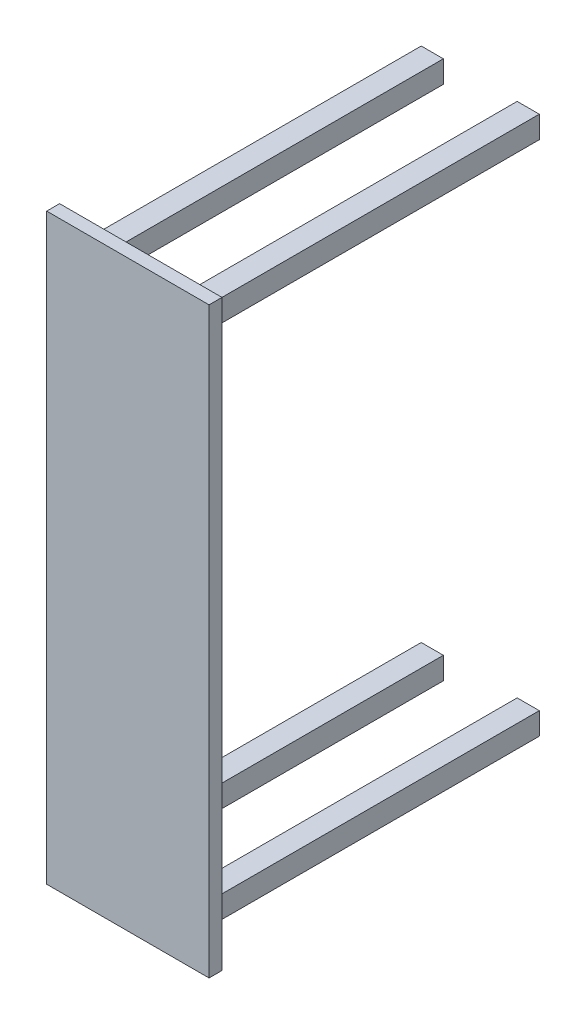
ISO-10303-21;
HEADER;
FILE_DESCRIPTION(('STEP AP214'),'2;1');
FILE_NAME('part.step','',(''),(''),'','','');
FILE_SCHEMA(('AUTOMOTIVE_DESIGN { 1 0 10303 214 1 1 1 1 }'));
ENDSEC;
DATA;
#1=APPLICATION_CONTEXT('core data for automotive mechanical design processes');
#2=APPLICATION_PROTOCOL_DEFINITION('international standard','automotive_design',2000,#1);
#3=PRODUCT_CONTEXT('',#1,'mechanical');
#4=PRODUCT('Part','Part','',(#3));
#5=PRODUCT_RELATED_PRODUCT_CATEGORY('part','',(#4));
#6=PRODUCT_DEFINITION_FORMATION('','',#4);
#7=PRODUCT_DEFINITION_CONTEXT('part definition',#1,'design');
#8=PRODUCT_DEFINITION('design','',#6,#7);
#9=PRODUCT_DEFINITION_SHAPE('','',#8);
#10=(LENGTH_UNIT() NAMED_UNIT(*) SI_UNIT(.MILLI.,.METRE.));
#11=(NAMED_UNIT(*) PLANE_ANGLE_UNIT() SI_UNIT($,.RADIAN.));
#12=(NAMED_UNIT(*) SI_UNIT($,.STERADIAN.) SOLID_ANGLE_UNIT());
#13=UNCERTAINTY_MEASURE_WITH_UNIT(LENGTH_MEASURE(1.E-05),#10,'distance_accuracy_value','');
#14=(GEOMETRIC_REPRESENTATION_CONTEXT(3) GLOBAL_UNCERTAINTY_ASSIGNED_CONTEXT((#13)) GLOBAL_UNIT_ASSIGNED_CONTEXT((#10,
#11,#12)) REPRESENTATION_CONTEXT('',''));
#15=CARTESIAN_POINT('',(0.,0.,0.));
#16=DIRECTION('',(0.,0.,1.));
#17=DIRECTION('',(1.,0.,0.));
#18=AXIS2_PLACEMENT_3D('',#15,#16,#17);
#19=CARTESIAN_POINT('',(0.,0.,0.));
#20=DIRECTION('',(0.,0.,1.));
#21=DIRECTION('',(1.,0.,0.));
#22=AXIS2_PLACEMENT_3D('',#19,#20,#21);
#23=PLANE('',#22);
#24=DIRECTION('',(0.,-1.,0.));
#25=VECTOR('',#24,1.);
#26=CARTESIAN_POINT('',(203.2,-850.9,0.));
#27=LINE('',#26,#25);
#28=CARTESIAN_POINT('',(203.2,-850.9,0.));
#29=VERTEX_POINT('',#28);
#30=CARTESIAN_POINT('',(203.2,-927.1,0.));
#31=VERTEX_POINT('',#30);
#32=EDGE_CURVE('E191',#29,#31,#27,.T.);
#33=ORIENTED_EDGE('',*,*,#32,.F.);
#34=DIRECTION('',(1.,0.,0.));
#35=VECTOR('',#34,1.);
#36=CARTESIAN_POINT('',(203.2,-850.9,0.));
#37=LINE('',#36,#35);
#38=CARTESIAN_POINT('',(127.,-850.9,0.));
#39=VERTEX_POINT('',#38);
#40=EDGE_CURVE('E204',#39,#29,#37,.T.);
#41=ORIENTED_EDGE('',*,*,#40,.F.);
#42=DIRECTION('',(0.,1.,0.));
#43=VECTOR('',#42,1.);
#44=CARTESIAN_POINT('',(127.,-850.9,0.));
#45=LINE('',#44,#43);
#46=CARTESIAN_POINT('',(127.,-927.1,0.));
#47=VERTEX_POINT('',#46);
#48=EDGE_CURVE('E213',#47,#39,#45,.T.);
#49=ORIENTED_EDGE('',*,*,#48,.F.);
#50=DIRECTION('',(-1.,0.,0.));
#51=VECTOR('',#50,1.);
#52=CARTESIAN_POINT('',(203.2,-927.1,0.));
#53=LINE('',#52,#51);
#54=EDGE_CURVE('E194',#31,#47,#53,.T.);
#55=ORIENTED_EDGE('',*,*,#54,.F.);
#56=EDGE_LOOP('',(#33,#41,#49,#55));
#57=FACE_BOUND('',#56,.T.);
#58=DIRECTION('',(0.,-1.,0.));
#59=VECTOR('',#58,1.);
#60=CARTESIAN_POINT('',(203.2,927.1,0.));
#61=LINE('',#60,#59);
#62=CARTESIAN_POINT('',(203.2,927.1,0.));
#63=VERTEX_POINT('',#62);
#64=CARTESIAN_POINT('',(203.2,850.9,0.));
#65=VERTEX_POINT('',#64);
#66=EDGE_CURVE('E262',#63,#65,#61,.T.);
#67=ORIENTED_EDGE('',*,*,#66,.F.);
#68=DIRECTION('',(1.,0.,0.));
#69=VECTOR('',#68,1.);
#70=CARTESIAN_POINT('',(203.2,927.1,0.));
#71=LINE('',#70,#69);
#72=CARTESIAN_POINT('',(127.,927.1,0.));
#73=VERTEX_POINT('',#72);
#74=EDGE_CURVE('E267',#73,#63,#71,.T.);
#75=ORIENTED_EDGE('',*,*,#74,.F.);
#76=DIRECTION('',(0.,1.,0.));
#77=VECTOR('',#76,1.);
#78=CARTESIAN_POINT('',(127.,927.1,0.));
#79=LINE('',#78,#77);
#80=CARTESIAN_POINT('',(127.,850.9,0.));
#81=VERTEX_POINT('',#80);
#82=EDGE_CURVE('E279',#81,#73,#79,.T.);
#83=ORIENTED_EDGE('',*,*,#82,.F.);
#84=DIRECTION('',(-1.,0.,0.));
#85=VECTOR('',#84,1.);
#86=CARTESIAN_POINT('',(203.2,850.9,0.));
#87=LINE('',#86,#85);
#88=EDGE_CURVE('E276',#65,#81,#87,.T.);
#89=ORIENTED_EDGE('',*,*,#88,.F.);
#90=EDGE_LOOP('',(#67,#75,#83,#89));
#91=FACE_BOUND('',#90,.T.);
#92=DIRECTION('',(0.,1.,0.));
#93=VECTOR('',#92,1.);
#94=CARTESIAN_POINT('',(279.4,1003.3,0.));
#95=LINE('',#94,#93);
#96=CARTESIAN_POINT('',(279.4,-1003.3,0.));
#97=VERTEX_POINT('',#96);
#98=CARTESIAN_POINT('',(279.4,1003.3,0.));
#99=VERTEX_POINT('',#98);
#100=EDGE_CURVE('E295',#97,#99,#95,.T.);
#101=ORIENTED_EDGE('',*,*,#100,.F.);
#102=DIRECTION('',(1.,0.,0.));
#103=VECTOR('',#102,1.);
#104=CARTESIAN_POINT('',(-279.4,-1003.3,0.));
#105=LINE('',#104,#103);
#106=CARTESIAN_POINT('',(-279.4,-1003.3,0.));
#107=VERTEX_POINT('',#106);
#108=EDGE_CURVE('E300',#107,#97,#105,.T.);
#109=ORIENTED_EDGE('',*,*,#108,.F.);
#110=DIRECTION('',(0.,-1.,0.));
#111=VECTOR('',#110,1.);
#112=CARTESIAN_POINT('',(-279.4,1003.3,0.));
#113=LINE('',#112,#111);
#114=CARTESIAN_POINT('',(-279.4,1003.3,0.));
#115=VERTEX_POINT('',#114);
#116=EDGE_CURVE('E311',#115,#107,#113,.T.);
#117=ORIENTED_EDGE('',*,*,#116,.F.);
#118=DIRECTION('',(-1.,0.,0.));
#119=VECTOR('',#118,1.);
#120=CARTESIAN_POINT('',(-279.4,1003.3,0.));
#121=LINE('',#120,#119);
#122=EDGE_CURVE('E309',#99,#115,#121,.T.);
#123=ORIENTED_EDGE('',*,*,#122,.F.);
#124=EDGE_LOOP('',(#101,#109,#117,#123));
#125=FACE_BOUND('',#124,.T.);
#126=DIRECTION('',(0.,-1.,0.));
#127=VECTOR('',#126,1.);
#128=CARTESIAN_POINT('',(-127.,927.1,0.));
#129=LINE('',#128,#127);
#130=CARTESIAN_POINT('',(-127.,927.1,0.));
#131=VERTEX_POINT('',#130);
#132=CARTESIAN_POINT('',(-127.,850.9,0.));
#133=VERTEX_POINT('',#132);
#134=EDGE_CURVE('E229',#131,#133,#129,.T.);
#135=ORIENTED_EDGE('',*,*,#134,.F.);
#136=DIRECTION('',(1.,0.,0.));
#137=VECTOR('',#136,1.);
#138=CARTESIAN_POINT('',(-127.,927.1,0.));
#139=LINE('',#138,#137);
#140=CARTESIAN_POINT('',(-203.2,927.1,0.));
#141=VERTEX_POINT('',#140);
#142=EDGE_CURVE('E234',#141,#131,#139,.T.);
#143=ORIENTED_EDGE('',*,*,#142,.F.);
#144=DIRECTION('',(0.,1.,0.));
#145=VECTOR('',#144,1.);
#146=CARTESIAN_POINT('',(-203.2,927.1,0.));
#147=LINE('',#146,#145);
#148=CARTESIAN_POINT('',(-203.2,850.9,0.));
#149=VERTEX_POINT('',#148);
#150=EDGE_CURVE('E246',#149,#141,#147,.T.);
#151=ORIENTED_EDGE('',*,*,#150,.F.);
#152=DIRECTION('',(-1.,0.,0.));
#153=VECTOR('',#152,1.);
#154=CARTESIAN_POINT('',(-127.,850.9,0.));
#155=LINE('',#154,#153);
#156=EDGE_CURVE('E243',#133,#149,#155,.T.);
#157=ORIENTED_EDGE('',*,*,#156,.F.);
#158=EDGE_LOOP('',(#135,#143,#151,#157));
#159=FACE_BOUND('',#158,.T.);
#160=DIRECTION('',(0.,-1.,0.));
#161=VECTOR('',#160,1.);
#162=CARTESIAN_POINT('',(-127.,-850.9,0.));
#163=LINE('',#162,#161);
#164=CARTESIAN_POINT('',(-127.,-850.9,0.));
#165=VERTEX_POINT('',#164);
#166=CARTESIAN_POINT('',(-127.,-927.1,0.));
#167=VERTEX_POINT('',#166);
#168=EDGE_CURVE('E190',#165,#167,#163,.T.);
#169=ORIENTED_EDGE('',*,*,#168,.F.);
#170=DIRECTION('',(1.,0.,0.));
#171=VECTOR('',#170,1.);
#172=CARTESIAN_POINT('',(-127.,-850.9,0.));
#173=LINE('',#172,#171);
#174=CARTESIAN_POINT('',(-203.2,-850.9,0.));
#175=VERTEX_POINT('',#174);
#176=EDGE_CURVE('E187',#175,#165,#173,.T.);
#177=ORIENTED_EDGE('',*,*,#176,.F.);
#178=DIRECTION('',(0.,1.,0.));
#179=VECTOR('',#178,1.);
#180=CARTESIAN_POINT('',(-203.2,-850.9,0.));
#181=LINE('',#180,#179);
#182=CARTESIAN_POINT('',(-203.2,-927.1,0.));
#183=VERTEX_POINT('',#182);
#184=EDGE_CURVE('E53',#183,#175,#181,.T.);
#185=ORIENTED_EDGE('',*,*,#184,.F.);
#186=DIRECTION('',(-1.,0.,0.));
#187=VECTOR('',#186,1.);
#188=CARTESIAN_POINT('',(-127.,-927.1,0.));
#189=LINE('',#188,#187);
#190=EDGE_CURVE('E48',#167,#183,#189,.T.);
#191=ORIENTED_EDGE('',*,*,#190,.F.);
#192=EDGE_LOOP('',(#169,#177,#185,#191));
#193=FACE_BOUND('',#192,.T.);
#194=ADVANCED_FACE('F33',(#57,#91,#125,#159,#193),#23,.F.);
#195=CARTESIAN_POINT('',(279.4,1003.3,44.45));
#196=DIRECTION('',(-1.,0.,0.));
#197=DIRECTION('',(0.,-1.,0.));
#198=AXIS2_PLACEMENT_3D('',#195,#196,#197);
#199=PLANE('',#198);
#200=ORIENTED_EDGE('',*,*,#100,.T.);
#201=DIRECTION('',(0.,0.,-1.));
#202=VECTOR('',#201,1.);
#203=CARTESIAN_POINT('',(279.4,1003.3,44.45));
#204=LINE('',#203,#202);
#205=CARTESIAN_POINT('',(279.4,1003.3,44.45));
#206=VERTEX_POINT('',#205);
#207=EDGE_CURVE('E11',#206,#99,#204,.T.);
#208=ORIENTED_EDGE('',*,*,#207,.F.);
#209=DIRECTION('',(0.,1.,0.));
#210=VECTOR('',#209,1.);
#211=CARTESIAN_POINT('',(279.4,1003.3,44.45));
#212=LINE('',#211,#210);
#213=CARTESIAN_POINT('',(279.4,-1003.3,44.45));
#214=VERTEX_POINT('',#213);
#215=EDGE_CURVE('E296',#214,#206,#212,.T.);
#216=ORIENTED_EDGE('',*,*,#215,.F.);
#217=DIRECTION('',(0.,0.,-1.));
#218=VECTOR('',#217,1.);
#219=CARTESIAN_POINT('',(279.4,-1003.3,44.45));
#220=LINE('',#219,#218);
#221=EDGE_CURVE('E306',#214,#97,#220,.T.);
#222=ORIENTED_EDGE('',*,*,#221,.T.);
#223=EDGE_LOOP('',(#200,#208,#216,#222));
#224=FACE_BOUND('',#223,.T.);
#225=ADVANCED_FACE('F35',(#224),#199,.F.);
#226=CARTESIAN_POINT('',(-279.4,1003.3,44.45));
#227=DIRECTION('',(0.,-1.,0.));
#228=DIRECTION('',(0.,0.,-1.));
#229=AXIS2_PLACEMENT_3D('',#226,#227,#228);
#230=PLANE('',#229);
#231=ORIENTED_EDGE('',*,*,#122,.T.);
#232=DIRECTION('',(0.,0.,-1.));
#233=VECTOR('',#232,1.);
#234=CARTESIAN_POINT('',(-279.4,1003.3,44.45));
#235=LINE('',#234,#233);
#236=CARTESIAN_POINT('',(-279.4,1003.3,44.45));
#237=VERTEX_POINT('',#236);
#238=EDGE_CURVE('E41',#237,#115,#235,.T.);
#239=ORIENTED_EDGE('',*,*,#238,.F.);
#240=DIRECTION('',(-1.,0.,0.));
#241=VECTOR('',#240,1.);
#242=CARTESIAN_POINT('',(-279.4,1003.3,44.45));
#243=LINE('',#242,#241);
#244=EDGE_CURVE('E299',#206,#237,#243,.T.);
#245=ORIENTED_EDGE('',*,*,#244,.F.);
#246=ORIENTED_EDGE('',*,*,#207,.T.);
#247=EDGE_LOOP('',(#231,#239,#245,#246));
#248=FACE_BOUND('',#247,.T.);
#249=ADVANCED_FACE('F339',(#248),#230,.F.);
#250=CARTESIAN_POINT('',(-279.4,1003.3,44.45));
#251=DIRECTION('',(1.,0.,0.));
#252=DIRECTION('',(0.,1.,0.));
#253=AXIS2_PLACEMENT_3D('',#250,#251,#252);
#254=PLANE('',#253);
#255=ORIENTED_EDGE('',*,*,#116,.T.);
#256=DIRECTION('',(0.,0.,-1.));
#257=VECTOR('',#256,1.);
#258=CARTESIAN_POINT('',(-279.4,-1003.3,44.45));
#259=LINE('',#258,#257);
#260=CARTESIAN_POINT('',(-279.4,-1003.3,44.45));
#261=VERTEX_POINT('',#260);
#262=EDGE_CURVE('E316',#261,#107,#259,.T.);
#263=ORIENTED_EDGE('',*,*,#262,.F.);
#264=DIRECTION('',(0.,-1.,0.));
#265=VECTOR('',#264,1.);
#266=CARTESIAN_POINT('',(-279.4,1003.3,44.45));
#267=LINE('',#266,#265);
#268=EDGE_CURVE('E302',#237,#261,#267,.T.);
#269=ORIENTED_EDGE('',*,*,#268,.F.);
#270=ORIENTED_EDGE('',*,*,#238,.T.);
#271=EDGE_LOOP('',(#255,#263,#269,#270));
#272=FACE_BOUND('',#271,.T.);
#273=ADVANCED_FACE('F323',(#272),#254,.F.);
#274=CARTESIAN_POINT('',(-279.4,-1003.3,44.45));
#275=DIRECTION('',(0.,1.,0.));
#276=DIRECTION('',(0.,0.,1.));
#277=AXIS2_PLACEMENT_3D('',#274,#275,#276);
#278=PLANE('',#277);
#279=ORIENTED_EDGE('',*,*,#108,.T.);
#280=ORIENTED_EDGE('',*,*,#221,.F.);
#281=DIRECTION('',(1.,0.,0.));
#282=VECTOR('',#281,1.);
#283=CARTESIAN_POINT('',(-279.4,-1003.3,44.45));
#284=LINE('',#283,#282);
#285=EDGE_CURVE('E304',#261,#214,#284,.T.);
#286=ORIENTED_EDGE('',*,*,#285,.F.);
#287=ORIENTED_EDGE('',*,*,#262,.T.);
#288=EDGE_LOOP('',(#279,#280,#286,#287));
#289=FACE_BOUND('',#288,.T.);
#290=ADVANCED_FACE('F332',(#289),#278,.F.);
#291=CARTESIAN_POINT('',(0.,0.,44.45));
#292=DIRECTION('',(0.,0.,1.));
#293=DIRECTION('',(1.,0.,0.));
#294=AXIS2_PLACEMENT_3D('',#291,#292,#293);
#295=PLANE('',#294);
#296=ORIENTED_EDGE('',*,*,#215,.T.);
#297=ORIENTED_EDGE('',*,*,#244,.T.);
#298=ORIENTED_EDGE('',*,*,#268,.T.);
#299=ORIENTED_EDGE('',*,*,#285,.T.);
#300=EDGE_LOOP('',(#296,#297,#298,#299));
#301=FACE_BOUND('',#300,.T.);
#302=ADVANCED_FACE('F338',(#301),#295,.T.);
#303=CARTESIAN_POINT('',(203.2,927.1,-1168.4));
#304=DIRECTION('',(-1.,0.,0.));
#305=DIRECTION('',(0.,0.,1.));
#306=AXIS2_PLACEMENT_3D('',#303,#304,#305);
#307=PLANE('',#306);
#308=ORIENTED_EDGE('',*,*,#66,.T.);
#309=DIRECTION('',(0.,0.,1.));
#310=VECTOR('',#309,1.);
#311=CARTESIAN_POINT('',(203.2,850.9,-1168.4));
#312=LINE('',#311,#310);
#313=CARTESIAN_POINT('',(203.2,850.9,-1168.4));
#314=VERTEX_POINT('',#313);
#315=EDGE_CURVE('E292',#314,#65,#312,.T.);
#316=ORIENTED_EDGE('',*,*,#315,.F.);
#317=DIRECTION('',(0.,-1.,0.));
#318=VECTOR('',#317,1.);
#319=CARTESIAN_POINT('',(203.2,927.1,-1168.4));
#320=LINE('',#319,#318);
#321=CARTESIAN_POINT('',(203.2,927.1,-1168.4));
#322=VERTEX_POINT('',#321);
#323=EDGE_CURVE('E263',#322,#314,#320,.T.);
#324=ORIENTED_EDGE('',*,*,#323,.F.);
#325=DIRECTION('',(0.,0.,1.));
#326=VECTOR('',#325,1.);
#327=CARTESIAN_POINT('',(203.2,927.1,-1168.4));
#328=LINE('',#327,#326);
#329=EDGE_CURVE('E273',#322,#63,#328,.T.);
#330=ORIENTED_EDGE('',*,*,#329,.T.);
#331=EDGE_LOOP('',(#308,#316,#324,#330));
#332=FACE_BOUND('',#331,.T.);
#333=ADVANCED_FACE('F359',(#332),#307,.F.);
#334=CARTESIAN_POINT('',(203.2,850.9,-1168.4));
#335=DIRECTION('',(0.,1.,0.));
#336=DIRECTION('',(-1.,0.,0.));
#337=AXIS2_PLACEMENT_3D('',#334,#335,#336);
#338=PLANE('',#337);
#339=ORIENTED_EDGE('',*,*,#88,.T.);
#340=DIRECTION('',(0.,0.,1.));
#341=VECTOR('',#340,1.);
#342=CARTESIAN_POINT('',(127.,850.9,-1168.4));
#343=LINE('',#342,#341);
#344=CARTESIAN_POINT('',(127.,850.9,-1168.4));
#345=VERTEX_POINT('',#344);
#346=EDGE_CURVE('E289',#345,#81,#343,.T.);
#347=ORIENTED_EDGE('',*,*,#346,.F.);
#348=DIRECTION('',(-1.,0.,0.));
#349=VECTOR('',#348,1.);
#350=CARTESIAN_POINT('',(203.2,850.9,-1168.4));
#351=LINE('',#350,#349);
#352=EDGE_CURVE('E266',#314,#345,#351,.T.);
#353=ORIENTED_EDGE('',*,*,#352,.F.);
#354=ORIENTED_EDGE('',*,*,#315,.T.);
#355=EDGE_LOOP('',(#339,#347,#353,#354));
#356=FACE_BOUND('',#355,.T.);
#357=ADVANCED_FACE('F363',(#356),#338,.F.);
#358=CARTESIAN_POINT('',(127.,927.1,-1168.4));
#359=DIRECTION('',(1.,0.,0.));
#360=DIRECTION('',(0.,0.,-1.));
#361=AXIS2_PLACEMENT_3D('',#358,#359,#360);
#362=PLANE('',#361);
#363=ORIENTED_EDGE('',*,*,#82,.T.);
#364=DIRECTION('',(0.,0.,1.));
#365=VECTOR('',#364,1.);
#366=CARTESIAN_POINT('',(127.,927.1,-1168.4));
#367=LINE('',#366,#365);
#368=CARTESIAN_POINT('',(127.,927.1,-1168.4));
#369=VERTEX_POINT('',#368);
#370=EDGE_CURVE('E286',#369,#73,#367,.T.);
#371=ORIENTED_EDGE('',*,*,#370,.F.);
#372=DIRECTION('',(0.,1.,0.));
#373=VECTOR('',#372,1.);
#374=CARTESIAN_POINT('',(127.,927.1,-1168.4));
#375=LINE('',#374,#373);
#376=EDGE_CURVE('E269',#345,#369,#375,.T.);
#377=ORIENTED_EDGE('',*,*,#376,.F.);
#378=ORIENTED_EDGE('',*,*,#346,.T.);
#379=EDGE_LOOP('',(#363,#371,#377,#378));
#380=FACE_BOUND('',#379,.T.);
#381=ADVANCED_FACE('F368',(#380),#362,.F.);
#382=CARTESIAN_POINT('',(203.2,927.1,-1168.4));
#383=DIRECTION('',(0.,-1.,0.));
#384=DIRECTION('',(0.,0.,-1.));
#385=AXIS2_PLACEMENT_3D('',#382,#383,#384);
#386=PLANE('',#385);
#387=ORIENTED_EDGE('',*,*,#74,.T.);
#388=ORIENTED_EDGE('',*,*,#329,.F.);
#389=DIRECTION('',(1.,0.,0.));
#390=VECTOR('',#389,1.);
#391=CARTESIAN_POINT('',(203.2,927.1,-1168.4));
#392=LINE('',#391,#390);
#393=EDGE_CURVE('E271',#369,#322,#392,.T.);
#394=ORIENTED_EDGE('',*,*,#393,.F.);
#395=ORIENTED_EDGE('',*,*,#370,.T.);
#396=EDGE_LOOP('',(#387,#388,#394,#395));
#397=FACE_BOUND('',#396,.T.);
#398=ADVANCED_FACE('F374',(#397),#386,.F.);
#399=CARTESIAN_POINT('',(0.,0.,-1168.4));
#400=DIRECTION('',(0.,0.,-1.));
#401=DIRECTION('',(-1.,0.,0.));
#402=AXIS2_PLACEMENT_3D('',#399,#400,#401);
#403=PLANE('',#402);
#404=ORIENTED_EDGE('',*,*,#323,.T.);
#405=ORIENTED_EDGE('',*,*,#352,.T.);
#406=ORIENTED_EDGE('',*,*,#376,.T.);
#407=ORIENTED_EDGE('',*,*,#393,.T.);
#408=EDGE_LOOP('',(#404,#405,#406,#407));
#409=FACE_BOUND('',#408,.T.);
#410=ADVANCED_FACE('F378',(#409),#403,.T.);
#411=CARTESIAN_POINT('',(-127.,927.1,-1168.4));
#412=DIRECTION('',(-1.,0.,0.));
#413=DIRECTION('',(0.,0.,1.));
#414=AXIS2_PLACEMENT_3D('',#411,#412,#413);
#415=PLANE('',#414);
#416=ORIENTED_EDGE('',*,*,#134,.T.);
#417=DIRECTION('',(0.,0.,1.));
#418=VECTOR('',#417,1.);
#419=CARTESIAN_POINT('',(-127.,850.9,-1168.4));
#420=LINE('',#419,#418);
#421=CARTESIAN_POINT('',(-127.,850.9,-1168.4));
#422=VERTEX_POINT('',#421);
#423=EDGE_CURVE('E259',#422,#133,#420,.T.);
#424=ORIENTED_EDGE('',*,*,#423,.F.);
#425=DIRECTION('',(0.,-1.,0.));
#426=VECTOR('',#425,1.);
#427=CARTESIAN_POINT('',(-127.,927.1,-1168.4));
#428=LINE('',#427,#426);
#429=CARTESIAN_POINT('',(-127.,927.1,-1168.4));
#430=VERTEX_POINT('',#429);
#431=EDGE_CURVE('E230',#430,#422,#428,.T.);
#432=ORIENTED_EDGE('',*,*,#431,.F.);
#433=DIRECTION('',(0.,0.,1.));
#434=VECTOR('',#433,1.);
#435=CARTESIAN_POINT('',(-127.,927.1,-1168.4));
#436=LINE('',#435,#434);
#437=EDGE_CURVE('E240',#430,#131,#436,.T.);
#438=ORIENTED_EDGE('',*,*,#437,.T.);
#439=EDGE_LOOP('',(#416,#424,#432,#438));
#440=FACE_BOUND('',#439,.T.);
#441=ADVANCED_FACE('F382',(#440),#415,.F.);
#442=CARTESIAN_POINT('',(-127.,850.9,-1168.4));
#443=DIRECTION('',(0.,1.,0.));
#444=DIRECTION('',(0.,0.,1.));
#445=AXIS2_PLACEMENT_3D('',#442,#443,#444);
#446=PLANE('',#445);
#447=ORIENTED_EDGE('',*,*,#156,.T.);
#448=DIRECTION('',(0.,0.,1.));
#449=VECTOR('',#448,1.);
#450=CARTESIAN_POINT('',(-203.2,850.9,-1168.4));
#451=LINE('',#450,#449);
#452=CARTESIAN_POINT('',(-203.2,850.9,-1168.4));
#453=VERTEX_POINT('',#452);
#454=EDGE_CURVE('E256',#453,#149,#451,.T.);
#455=ORIENTED_EDGE('',*,*,#454,.F.);
#456=DIRECTION('',(-1.,0.,0.));
#457=VECTOR('',#456,1.);
#458=CARTESIAN_POINT('',(-127.,850.9,-1168.4));
#459=LINE('',#458,#457);
#460=EDGE_CURVE('E233',#422,#453,#459,.T.);
#461=ORIENTED_EDGE('',*,*,#460,.F.);
#462=ORIENTED_EDGE('',*,*,#423,.T.);
#463=EDGE_LOOP('',(#447,#455,#461,#462));
#464=FACE_BOUND('',#463,.T.);
#465=ADVANCED_FACE('F386',(#464),#446,.F.);
#466=CARTESIAN_POINT('',(-203.2,927.1,-1168.4));
#467=DIRECTION('',(1.,0.,0.));
#468=DIRECTION('',(0.,0.,-1.));
#469=AXIS2_PLACEMENT_3D('',#466,#467,#468);
#470=PLANE('',#469);
#471=ORIENTED_EDGE('',*,*,#150,.T.);
#472=DIRECTION('',(0.,0.,1.));
#473=VECTOR('',#472,1.);
#474=CARTESIAN_POINT('',(-203.2,927.1,-1168.4));
#475=LINE('',#474,#473);
#476=CARTESIAN_POINT('',(-203.2,927.1,-1168.4));
#477=VERTEX_POINT('',#476);
#478=EDGE_CURVE('E253',#477,#141,#475,.T.);
#479=ORIENTED_EDGE('',*,*,#478,.F.);
#480=DIRECTION('',(0.,1.,0.));
#481=VECTOR('',#480,1.);
#482=CARTESIAN_POINT('',(-203.2,927.1,-1168.4));
#483=LINE('',#482,#481);
#484=EDGE_CURVE('E236',#453,#477,#483,.T.);
#485=ORIENTED_EDGE('',*,*,#484,.F.);
#486=ORIENTED_EDGE('',*,*,#454,.T.);
#487=EDGE_LOOP('',(#471,#479,#485,#486));
#488=FACE_BOUND('',#487,.T.);
#489=ADVANCED_FACE('F390',(#488),#470,.F.);
#490=CARTESIAN_POINT('',(-127.,927.1,-1168.4));
#491=DIRECTION('',(0.,-1.,0.));
#492=DIRECTION('',(0.,0.,-1.));
#493=AXIS2_PLACEMENT_3D('',#490,#491,#492);
#494=PLANE('',#493);
#495=ORIENTED_EDGE('',*,*,#142,.T.);
#496=ORIENTED_EDGE('',*,*,#437,.F.);
#497=DIRECTION('',(1.,0.,0.));
#498=VECTOR('',#497,1.);
#499=CARTESIAN_POINT('',(-127.,927.1,-1168.4));
#500=LINE('',#499,#498);
#501=EDGE_CURVE('E238',#477,#430,#500,.T.);
#502=ORIENTED_EDGE('',*,*,#501,.F.);
#503=ORIENTED_EDGE('',*,*,#478,.T.);
#504=EDGE_LOOP('',(#495,#496,#502,#503));
#505=FACE_BOUND('',#504,.T.);
#506=ADVANCED_FACE('F394',(#505),#494,.F.);
#507=CARTESIAN_POINT('',(0.,0.,-1168.4));
#508=DIRECTION('',(0.,0.,-1.));
#509=DIRECTION('',(-1.,0.,0.));
#510=AXIS2_PLACEMENT_3D('',#507,#508,#509);
#511=PLANE('',#510);
#512=ORIENTED_EDGE('',*,*,#431,.T.);
#513=ORIENTED_EDGE('',*,*,#460,.T.);
#514=ORIENTED_EDGE('',*,*,#484,.T.);
#515=ORIENTED_EDGE('',*,*,#501,.T.);
#516=EDGE_LOOP('',(#512,#513,#514,#515));
#517=FACE_BOUND('',#516,.T.);
#518=ADVANCED_FACE('F398',(#517),#511,.T.);
#519=CARTESIAN_POINT('',(203.2,-850.9,-1168.4));
#520=DIRECTION('',(-1.,0.,0.));
#521=DIRECTION('',(0.,0.,1.));
#522=AXIS2_PLACEMENT_3D('',#519,#520,#521);
#523=PLANE('',#522);
#524=ORIENTED_EDGE('',*,*,#32,.T.);
#525=DIRECTION('',(0.,0.,1.));
#526=VECTOR('',#525,1.);
#527=CARTESIAN_POINT('',(203.2,-927.1,-1168.4));
#528=LINE('',#527,#526);
#529=CARTESIAN_POINT('',(203.2,-927.1,-1168.4));
#530=VERTEX_POINT('',#529);
#531=EDGE_CURVE('E226',#530,#31,#528,.T.);
#532=ORIENTED_EDGE('',*,*,#531,.F.);
#533=DIRECTION('',(0.,-1.,0.));
#534=VECTOR('',#533,1.);
#535=CARTESIAN_POINT('',(203.2,-850.9,-1168.4));
#536=LINE('',#535,#534);
#537=CARTESIAN_POINT('',(203.2,-850.9,-1168.4));
#538=VERTEX_POINT('',#537);
#539=EDGE_CURVE('E200',#538,#530,#536,.T.);
#540=ORIENTED_EDGE('',*,*,#539,.F.);
#541=DIRECTION('',(0.,0.,1.));
#542=VECTOR('',#541,1.);
#543=CARTESIAN_POINT('',(203.2,-850.9,-1168.4));
#544=LINE('',#543,#542);
#545=EDGE_CURVE('E209',#538,#29,#544,.T.);
#546=ORIENTED_EDGE('',*,*,#545,.T.);
#547=EDGE_LOOP('',(#524,#532,#540,#546));
#548=FACE_BOUND('',#547,.T.);
#549=ADVANCED_FACE('F402',(#548),#523,.F.);
#550=CARTESIAN_POINT('',(203.2,-927.1,-1168.4));
#551=DIRECTION('',(0.,1.,0.));
#552=DIRECTION('',(0.,0.,1.));
#553=AXIS2_PLACEMENT_3D('',#550,#551,#552);
#554=PLANE('',#553);
#555=ORIENTED_EDGE('',*,*,#54,.T.);
#556=DIRECTION('',(0.,0.,1.));
#557=VECTOR('',#556,1.);
#558=CARTESIAN_POINT('',(127.,-927.1,-1168.4));
#559=LINE('',#558,#557);
#560=CARTESIAN_POINT('',(127.,-927.1,-1168.4));
#561=VERTEX_POINT('',#560);
#562=EDGE_CURVE('E223',#561,#47,#559,.T.);
#563=ORIENTED_EDGE('',*,*,#562,.F.);
#564=DIRECTION('',(-1.,0.,0.));
#565=VECTOR('',#564,1.);
#566=CARTESIAN_POINT('',(203.2,-927.1,-1168.4));
#567=LINE('',#566,#565);
#568=EDGE_CURVE('E203',#530,#561,#567,.T.);
#569=ORIENTED_EDGE('',*,*,#568,.F.);
#570=ORIENTED_EDGE('',*,*,#531,.T.);
#571=EDGE_LOOP('',(#555,#563,#569,#570));
#572=FACE_BOUND('',#571,.T.);
#573=ADVANCED_FACE('F406',(#572),#554,.F.);
#574=CARTESIAN_POINT('',(127.,-850.9,-1168.4));
#575=DIRECTION('',(1.,0.,0.));
#576=DIRECTION('',(0.,0.,-1.));
#577=AXIS2_PLACEMENT_3D('',#574,#575,#576);
#578=PLANE('',#577);
#579=ORIENTED_EDGE('',*,*,#48,.T.);
#580=DIRECTION('',(0.,0.,1.));
#581=VECTOR('',#580,1.);
#582=CARTESIAN_POINT('',(127.,-850.9,-1168.4));
#583=LINE('',#582,#581);
#584=CARTESIAN_POINT('',(127.,-850.9,-1168.4));
#585=VERTEX_POINT('',#584);
#586=EDGE_CURVE('E220',#585,#39,#583,.T.);
#587=ORIENTED_EDGE('',*,*,#586,.F.);
#588=DIRECTION('',(0.,1.,0.));
#589=VECTOR('',#588,1.);
#590=CARTESIAN_POINT('',(127.,-850.9,-1168.4));
#591=LINE('',#590,#589);
#592=EDGE_CURVE('E206',#561,#585,#591,.T.);
#593=ORIENTED_EDGE('',*,*,#592,.F.);
#594=ORIENTED_EDGE('',*,*,#562,.T.);
#595=EDGE_LOOP('',(#579,#587,#593,#594));
#596=FACE_BOUND('',#595,.T.);
#597=ADVANCED_FACE('F410',(#596),#578,.F.);
#598=CARTESIAN_POINT('',(203.2,-850.9,-1168.4));
#599=DIRECTION('',(0.,-1.,0.));
#600=DIRECTION('',(0.,0.,-1.));
#601=AXIS2_PLACEMENT_3D('',#598,#599,#600);
#602=PLANE('',#601);
#603=ORIENTED_EDGE('',*,*,#40,.T.);
#604=ORIENTED_EDGE('',*,*,#545,.F.);
#605=DIRECTION('',(1.,0.,0.));
#606=VECTOR('',#605,1.);
#607=CARTESIAN_POINT('',(203.2,-850.9,-1168.4));
#608=LINE('',#607,#606);
#609=EDGE_CURVE('E208',#585,#538,#608,.T.);
#610=ORIENTED_EDGE('',*,*,#609,.F.);
#611=ORIENTED_EDGE('',*,*,#586,.T.);
#612=EDGE_LOOP('',(#603,#604,#610,#611));
#613=FACE_BOUND('',#612,.T.);
#614=ADVANCED_FACE('F414',(#613),#602,.F.);
#615=CARTESIAN_POINT('',(0.,0.,-1168.4));
#616=DIRECTION('',(0.,0.,-1.));
#617=DIRECTION('',(-1.,0.,0.));
#618=AXIS2_PLACEMENT_3D('',#615,#616,#617);
#619=PLANE('',#618);
#620=ORIENTED_EDGE('',*,*,#539,.T.);
#621=ORIENTED_EDGE('',*,*,#568,.T.);
#622=ORIENTED_EDGE('',*,*,#592,.T.);
#623=ORIENTED_EDGE('',*,*,#609,.T.);
#624=EDGE_LOOP('',(#620,#621,#622,#623));
#625=FACE_BOUND('',#624,.T.);
#626=ADVANCED_FACE('F418',(#625),#619,.T.);
#627=CARTESIAN_POINT('',(-127.,-850.9,-1168.4));
#628=DIRECTION('',(-1.,0.,0.));
#629=DIRECTION('',(0.,0.,1.));
#630=AXIS2_PLACEMENT_3D('',#627,#628,#629);
#631=PLANE('',#630);
#632=ORIENTED_EDGE('',*,*,#168,.T.);
#633=DIRECTION('',(0.,0.,1.));
#634=VECTOR('',#633,1.);
#635=CARTESIAN_POINT('',(-127.,-927.1,-1168.4));
#636=LINE('',#635,#634);
#637=CARTESIAN_POINT('',(-127.,-927.1,-1168.4));
#638=VERTEX_POINT('',#637);
#639=EDGE_CURVE('E171',#638,#167,#636,.T.);
#640=ORIENTED_EDGE('',*,*,#639,.F.);
#641=DIRECTION('',(0.,-1.,0.));
#642=VECTOR('',#641,1.);
#643=CARTESIAN_POINT('',(-127.,-850.9,-1168.4));
#644=LINE('',#643,#642);
#645=CARTESIAN_POINT('',(-127.,-850.9,-1168.4));
#646=VERTEX_POINT('',#645);
#647=EDGE_CURVE('E178',#646,#638,#644,.T.);
#648=ORIENTED_EDGE('',*,*,#647,.F.);
#649=DIRECTION('',(0.,0.,1.));
#650=VECTOR('',#649,1.);
#651=CARTESIAN_POINT('',(-127.,-850.9,-1168.4));
#652=LINE('',#651,#650);
#653=EDGE_CURVE('E584',#646,#165,#652,.T.);
#654=ORIENTED_EDGE('',*,*,#653,.T.);
#655=EDGE_LOOP('',(#632,#640,#648,#654));
#656=FACE_BOUND('',#655,.T.);
#657=ADVANCED_FACE('F189',(#656),#631,.F.);
#658=CARTESIAN_POINT('',(-127.,-927.1,-1168.4));
#659=DIRECTION('',(0.,1.,0.));
#660=DIRECTION('',(0.,0.,1.));
#661=AXIS2_PLACEMENT_3D('',#658,#659,#660);
#662=PLANE('',#661);
#663=ORIENTED_EDGE('',*,*,#190,.T.);
#664=DIRECTION('',(0.,0.,1.));
#665=VECTOR('',#664,1.);
#666=CARTESIAN_POINT('',(-203.2,-927.1,-1168.4));
#667=LINE('',#666,#665);
#668=CARTESIAN_POINT('',(-203.2,-927.1,-1168.4));
#669=VERTEX_POINT('',#668);
#670=EDGE_CURVE('E174',#669,#183,#667,.T.);
#671=ORIENTED_EDGE('',*,*,#670,.F.);
#672=DIRECTION('',(-1.,0.,0.));
#673=VECTOR('',#672,1.);
#674=CARTESIAN_POINT('',(-127.,-927.1,-1168.4));
#675=LINE('',#674,#673);
#676=EDGE_CURVE('E167',#638,#669,#675,.T.);
#677=ORIENTED_EDGE('',*,*,#676,.F.);
#678=ORIENTED_EDGE('',*,*,#639,.T.);
#679=EDGE_LOOP('',(#663,#671,#677,#678));
#680=FACE_BOUND('',#679,.T.);
#681=ADVANCED_FACE('F169',(#680),#662,.F.);
#682=CARTESIAN_POINT('',(-203.2,-850.9,-1168.4));
#683=DIRECTION('',(1.,0.,0.));
#684=DIRECTION('',(0.,0.,-1.));
#685=AXIS2_PLACEMENT_3D('',#682,#683,#684);
#686=PLANE('',#685);
#687=ORIENTED_EDGE('',*,*,#184,.T.);
#688=DIRECTION('',(0.,0.,1.));
#689=VECTOR('',#688,1.);
#690=CARTESIAN_POINT('',(-203.2,-850.9,-1168.4));
#691=LINE('',#690,#689);
#692=CARTESIAN_POINT('',(-203.2,-850.9,-1168.4));
#693=VERTEX_POINT('',#692);
#694=EDGE_CURVE('E196',#693,#175,#691,.T.);
#695=ORIENTED_EDGE('',*,*,#694,.F.);
#696=DIRECTION('',(0.,1.,0.));
#697=VECTOR('',#696,1.);
#698=CARTESIAN_POINT('',(-203.2,-850.9,-1168.4));
#699=LINE('',#698,#697);
#700=EDGE_CURVE('E177',#669,#693,#699,.T.);
#701=ORIENTED_EDGE('',*,*,#700,.F.);
#702=ORIENTED_EDGE('',*,*,#670,.T.);
#703=EDGE_LOOP('',(#687,#695,#701,#702));
#704=FACE_BOUND('',#703,.T.);
#705=ADVANCED_FACE('F427',(#704),#686,.F.);
#706=CARTESIAN_POINT('',(-127.,-850.9,-1168.4));
#707=DIRECTION('',(0.,-1.,0.));
#708=DIRECTION('',(0.,0.,-1.));
#709=AXIS2_PLACEMENT_3D('',#706,#707,#708);
#710=PLANE('',#709);
#711=ORIENTED_EDGE('',*,*,#176,.T.);
#712=ORIENTED_EDGE('',*,*,#653,.F.);
#713=DIRECTION('',(1.,0.,0.));
#714=VECTOR('',#713,1.);
#715=CARTESIAN_POINT('',(-127.,-850.9,-1168.4));
#716=LINE('',#715,#714);
#717=EDGE_CURVE('E183',#693,#646,#716,.T.);
#718=ORIENTED_EDGE('',*,*,#717,.F.);
#719=ORIENTED_EDGE('',*,*,#694,.T.);
#720=EDGE_LOOP('',(#711,#712,#718,#719));
#721=FACE_BOUND('',#720,.T.);
#722=ADVANCED_FACE('F430',(#721),#710,.F.);
#723=CARTESIAN_POINT('',(0.,0.,-1168.4));
#724=DIRECTION('',(0.,0.,-1.));
#725=DIRECTION('',(-1.,0.,0.));
#726=AXIS2_PLACEMENT_3D('',#723,#724,#725);
#727=PLANE('',#726);
#728=ORIENTED_EDGE('',*,*,#647,.T.);
#729=ORIENTED_EDGE('',*,*,#676,.T.);
#730=ORIENTED_EDGE('',*,*,#700,.T.);
#731=ORIENTED_EDGE('',*,*,#717,.T.);
#732=EDGE_LOOP('',(#728,#729,#730,#731));
#733=FACE_BOUND('',#732,.T.);
#734=ADVANCED_FACE('F181',(#733),#727,.T.);
#735=CLOSED_SHELL('',(#194,#225,#249,#273,#290,#302,#333,#357,#381,#398,#410,#441,#465,#489,
#506,#518,#549,#573,#597,#614,#626,#657,#681,#705,#722,#734));
#736=MANIFOLD_SOLID_BREP('B2',#735);
#737=ADVANCED_BREP_SHAPE_REPRESENTATION('',(#18,#736),#14);
#738=SHAPE_DEFINITION_REPRESENTATION(#9,#737);
ENDSEC;
END-ISO-10303-21;
